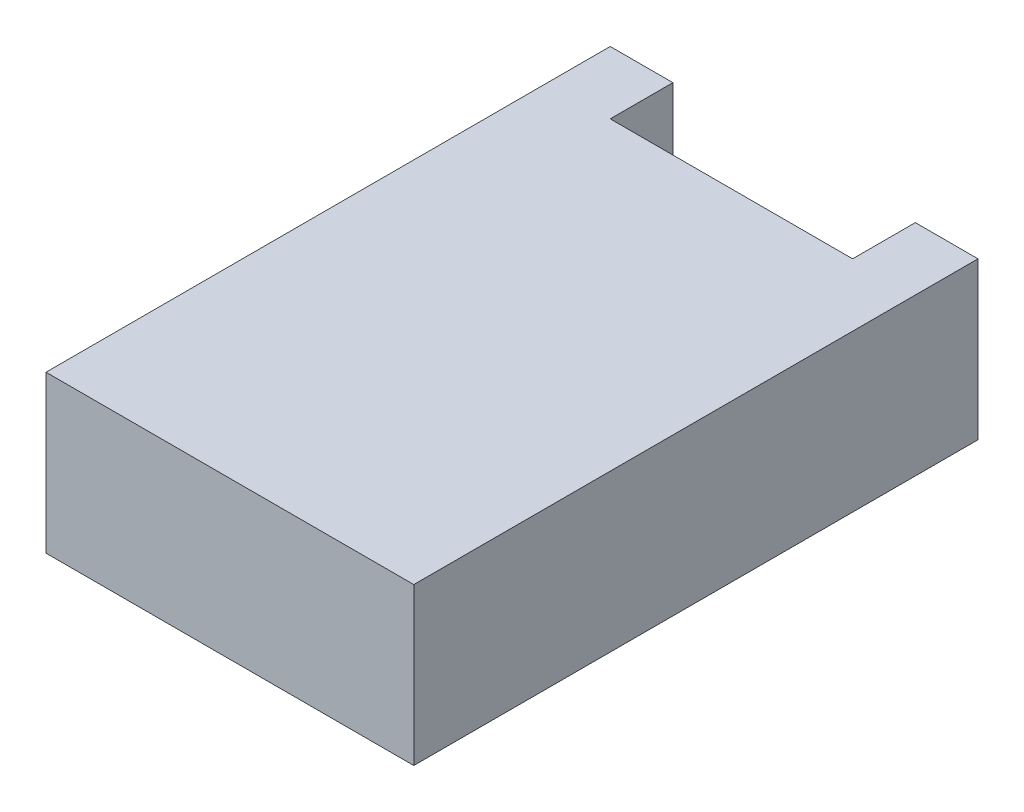
ISO-10303-21;
HEADER;
FILE_DESCRIPTION(('STEP AP214'),'2;1');
FILE_NAME('part.step','',(''),(''),'','','');
FILE_SCHEMA(('AUTOMOTIVE_DESIGN { 1 0 10303 214 1 1 1 1 }'));
ENDSEC;
DATA;
#1=APPLICATION_CONTEXT('core data for automotive mechanical design processes');
#2=APPLICATION_PROTOCOL_DEFINITION('international standard','automotive_design',2000,#1);
#3=PRODUCT_CONTEXT('',#1,'mechanical');
#4=PRODUCT('Part','Part','',(#3));
#5=PRODUCT_RELATED_PRODUCT_CATEGORY('part','',(#4));
#6=PRODUCT_DEFINITION_FORMATION('','',#4);
#7=PRODUCT_DEFINITION_CONTEXT('part definition',#1,'design');
#8=PRODUCT_DEFINITION('design','',#6,#7);
#9=PRODUCT_DEFINITION_SHAPE('','',#8);
#10=(LENGTH_UNIT() NAMED_UNIT(*) SI_UNIT(.MILLI.,.METRE.));
#11=(NAMED_UNIT(*) PLANE_ANGLE_UNIT() SI_UNIT($,.RADIAN.));
#12=(NAMED_UNIT(*) SI_UNIT($,.STERADIAN.) SOLID_ANGLE_UNIT());
#13=UNCERTAINTY_MEASURE_WITH_UNIT(LENGTH_MEASURE(1.E-05),#10,'distance_accuracy_value','');
#14=(GEOMETRIC_REPRESENTATION_CONTEXT(3) GLOBAL_UNCERTAINTY_ASSIGNED_CONTEXT((#13)) GLOBAL_UNIT_ASSIGNED_CONTEXT((#10,
#11,#12)) REPRESENTATION_CONTEXT('',''));
#15=CARTESIAN_POINT('',(0.,0.,0.));
#16=DIRECTION('',(0.,0.,1.));
#17=DIRECTION('',(1.,0.,0.));
#18=AXIS2_PLACEMENT_3D('',#15,#16,#17);
#19=CARTESIAN_POINT('',(8.8,7.5,-15.));
#20=DIRECTION('',(0.,0.,1.));
#21=DIRECTION('',(1.,0.,0.));
#22=AXIS2_PLACEMENT_3D('',#19,#20,#21);
#23=PLANE('',#22);
#24=DIRECTION('',(-1.,0.,0.));
#25=VECTOR('',#24,1.);
#26=CARTESIAN_POINT('',(8.8,0.,-15.));
#27=LINE('',#26,#25);
#28=CARTESIAN_POINT('',(8.8,0.,-15.));
#29=VERTEX_POINT('',#28);
#30=CARTESIAN_POINT('',(5.8,0.,-15.));
#31=VERTEX_POINT('',#30);
#32=EDGE_CURVE('E134',#29,#31,#27,.T.);
#33=ORIENTED_EDGE('',*,*,#32,.T.);
#34=DIRECTION('',(0.,-1.,0.));
#35=VECTOR('',#34,1.);
#36=CARTESIAN_POINT('',(5.8,7.5,-15.));
#37=LINE('',#36,#35);
#38=CARTESIAN_POINT('',(5.8,7.5,-15.));
#39=VERTEX_POINT('',#38);
#40=EDGE_CURVE('E42',#39,#31,#37,.T.);
#41=ORIENTED_EDGE('',*,*,#40,.F.);
#42=DIRECTION('',(-1.,0.,0.));
#43=VECTOR('',#42,1.);
#44=CARTESIAN_POINT('',(8.8,7.5,-15.));
#45=LINE('',#44,#43);
#46=CARTESIAN_POINT('',(8.8,7.5,-15.));
#47=VERTEX_POINT('',#46);
#48=EDGE_CURVE('E93',#47,#39,#45,.T.);
#49=ORIENTED_EDGE('',*,*,#48,.F.);
#50=DIRECTION('',(0.,-1.,0.));
#51=VECTOR('',#50,1.);
#52=CARTESIAN_POINT('',(8.8,7.5,-15.));
#53=LINE('',#52,#51);
#54=EDGE_CURVE('E11',#47,#29,#53,.T.);
#55=ORIENTED_EDGE('',*,*,#54,.T.);
#56=EDGE_LOOP('',(#33,#41,#49,#55));
#57=FACE_BOUND('',#56,.T.);
#58=ADVANCED_FACE('F34',(#57),#23,.F.);
#59=CARTESIAN_POINT('',(5.8,7.5,-12.));
#60=DIRECTION('',(1.,0.,0.));
#61=DIRECTION('',(0.,0.,-1.));
#62=AXIS2_PLACEMENT_3D('',#59,#60,#61);
#63=PLANE('',#62);
#64=DIRECTION('',(0.,0.,1.));
#65=VECTOR('',#64,1.);
#66=CARTESIAN_POINT('',(5.8,0.,-12.));
#67=LINE('',#66,#65);
#68=CARTESIAN_POINT('',(5.8,0.,-12.));
#69=VERTEX_POINT('',#68);
#70=EDGE_CURVE('E136',#31,#69,#67,.T.);
#71=ORIENTED_EDGE('',*,*,#70,.T.);
#72=DIRECTION('',(0.,-1.,0.));
#73=VECTOR('',#72,1.);
#74=CARTESIAN_POINT('',(5.8,7.5,-12.));
#75=LINE('',#74,#73);
#76=CARTESIAN_POINT('',(5.8,7.5,-12.));
#77=VERTEX_POINT('',#76);
#78=EDGE_CURVE('E153',#77,#69,#75,.T.);
#79=ORIENTED_EDGE('',*,*,#78,.F.);
#80=DIRECTION('',(0.,0.,1.));
#81=VECTOR('',#80,1.);
#82=CARTESIAN_POINT('',(5.8,7.5,-12.));
#83=LINE('',#82,#81);
#84=EDGE_CURVE('E161',#39,#77,#83,.T.);
#85=ORIENTED_EDGE('',*,*,#84,.F.);
#86=ORIENTED_EDGE('',*,*,#40,.T.);
#87=EDGE_LOOP('',(#71,#79,#85,#86));
#88=FACE_BOUND('',#87,.T.);
#89=ADVANCED_FACE('F159',(#88),#63,.F.);
#90=CARTESIAN_POINT('',(-5.8,7.5,-12.));
#91=DIRECTION('',(0.,0.,1.));
#92=DIRECTION('',(1.,0.,0.));
#93=AXIS2_PLACEMENT_3D('',#90,#91,#92);
#94=PLANE('',#93);
#95=DIRECTION('',(-1.,0.,0.));
#96=VECTOR('',#95,1.);
#97=CARTESIAN_POINT('',(-5.8,0.,-12.));
#98=LINE('',#97,#96);
#99=CARTESIAN_POINT('',(-5.8,0.,-12.));
#100=VERTEX_POINT('',#99);
#101=EDGE_CURVE('E138',#69,#100,#98,.T.);
#102=ORIENTED_EDGE('',*,*,#101,.T.);
#103=DIRECTION('',(0.,-1.,0.));
#104=VECTOR('',#103,1.);
#105=CARTESIAN_POINT('',(-5.8,7.5,-12.));
#106=LINE('',#105,#104);
#107=CARTESIAN_POINT('',(-5.8,7.5,-12.));
#108=VERTEX_POINT('',#107);
#109=EDGE_CURVE('E150',#108,#100,#106,.T.);
#110=ORIENTED_EDGE('',*,*,#109,.F.);
#111=DIRECTION('',(-1.,0.,0.));
#112=VECTOR('',#111,1.);
#113=CARTESIAN_POINT('',(-5.8,7.5,-12.));
#114=LINE('',#113,#112);
#115=EDGE_CURVE('E174',#77,#108,#114,.T.);
#116=ORIENTED_EDGE('',*,*,#115,.F.);
#117=ORIENTED_EDGE('',*,*,#78,.T.);
#118=EDGE_LOOP('',(#102,#110,#116,#117));
#119=FACE_BOUND('',#118,.T.);
#120=ADVANCED_FACE('F170',(#119),#94,.F.);
#121=CARTESIAN_POINT('',(-5.8,7.5,-12.));
#122=DIRECTION('',(-1.,0.,0.));
#123=DIRECTION('',(0.,0.,1.));
#124=AXIS2_PLACEMENT_3D('',#121,#122,#123);
#125=PLANE('',#124);
#126=DIRECTION('',(0.,0.,-1.));
#127=VECTOR('',#126,1.);
#128=CARTESIAN_POINT('',(-5.8,0.,-12.));
#129=LINE('',#128,#127);
#130=CARTESIAN_POINT('',(-5.8,0.,-15.));
#131=VERTEX_POINT('',#130);
#132=EDGE_CURVE('E140',#100,#131,#129,.T.);
#133=ORIENTED_EDGE('',*,*,#132,.T.);
#134=DIRECTION('',(0.,-1.,0.));
#135=VECTOR('',#134,1.);
#136=CARTESIAN_POINT('',(-5.8,7.5,-15.));
#137=LINE('',#136,#135);
#138=CARTESIAN_POINT('',(-5.8,7.5,-15.));
#139=VERTEX_POINT('',#138);
#140=EDGE_CURVE('E123',#139,#131,#137,.T.);
#141=ORIENTED_EDGE('',*,*,#140,.F.);
#142=DIRECTION('',(0.,0.,-1.));
#143=VECTOR('',#142,1.);
#144=CARTESIAN_POINT('',(-5.8,7.5,-12.));
#145=LINE('',#144,#143);
#146=EDGE_CURVE('E113',#108,#139,#145,.T.);
#147=ORIENTED_EDGE('',*,*,#146,.F.);
#148=ORIENTED_EDGE('',*,*,#109,.T.);
#149=EDGE_LOOP('',(#133,#141,#147,#148));
#150=FACE_BOUND('',#149,.T.);
#151=ADVANCED_FACE('F173',(#150),#125,.F.);
#152=CARTESIAN_POINT('',(-8.8,7.5,-15.));
#153=DIRECTION('',(0.,0.,1.));
#154=DIRECTION('',(1.,0.,0.));
#155=AXIS2_PLACEMENT_3D('',#152,#153,#154);
#156=PLANE('',#155);
#157=DIRECTION('',(-1.,0.,0.));
#158=VECTOR('',#157,1.);
#159=CARTESIAN_POINT('',(-8.8,0.,-15.));
#160=LINE('',#159,#158);
#161=CARTESIAN_POINT('',(-8.8,0.,-15.));
#162=VERTEX_POINT('',#161);
#163=EDGE_CURVE('E122',#131,#162,#160,.T.);
#164=ORIENTED_EDGE('',*,*,#163,.T.);
#165=DIRECTION('',(0.,-1.,0.));
#166=VECTOR('',#165,1.);
#167=CARTESIAN_POINT('',(-8.8,7.5,-15.));
#168=LINE('',#167,#166);
#169=CARTESIAN_POINT('',(-8.8,7.5,-15.));
#170=VERTEX_POINT('',#169);
#171=EDGE_CURVE('E119',#170,#162,#168,.T.);
#172=ORIENTED_EDGE('',*,*,#171,.F.);
#173=DIRECTION('',(-1.,0.,0.));
#174=VECTOR('',#173,1.);
#175=CARTESIAN_POINT('',(-8.8,7.5,-15.));
#176=LINE('',#175,#174);
#177=EDGE_CURVE('E107',#139,#170,#176,.T.);
#178=ORIENTED_EDGE('',*,*,#177,.F.);
#179=ORIENTED_EDGE('',*,*,#140,.T.);
#180=EDGE_LOOP('',(#164,#172,#178,#179));
#181=FACE_BOUND('',#180,.T.);
#182=ADVANCED_FACE('F120',(#181),#156,.F.);
#183=CARTESIAN_POINT('',(-8.8,7.5,12.));
#184=DIRECTION('',(1.,0.,0.));
#185=DIRECTION('',(0.,0.,-1.));
#186=AXIS2_PLACEMENT_3D('',#183,#184,#185);
#187=PLANE('',#186);
#188=DIRECTION('',(0.,0.,1.));
#189=VECTOR('',#188,1.);
#190=CARTESIAN_POINT('',(-8.8,0.,12.));
#191=LINE('',#190,#189);
#192=CARTESIAN_POINT('',(-8.8,0.,12.));
#193=VERTEX_POINT('',#192);
#194=EDGE_CURVE('E79',#162,#193,#191,.T.);
#195=ORIENTED_EDGE('',*,*,#194,.T.);
#196=DIRECTION('',(0.,-1.,0.));
#197=VECTOR('',#196,1.);
#198=CARTESIAN_POINT('',(-8.8,7.5,12.));
#199=LINE('',#198,#197);
#200=CARTESIAN_POINT('',(-8.8,7.5,12.));
#201=VERTEX_POINT('',#200);
#202=EDGE_CURVE('E124',#201,#193,#199,.T.);
#203=ORIENTED_EDGE('',*,*,#202,.F.);
#204=DIRECTION('',(0.,0.,1.));
#205=VECTOR('',#204,1.);
#206=CARTESIAN_POINT('',(-8.8,7.5,-12.));
#207=LINE('',#206,#205);
#208=EDGE_CURVE('E111',#170,#201,#207,.T.);
#209=ORIENTED_EDGE('',*,*,#208,.F.);
#210=ORIENTED_EDGE('',*,*,#171,.T.);
#211=EDGE_LOOP('',(#195,#203,#209,#210));
#212=FACE_BOUND('',#211,.T.);
#213=ADVANCED_FACE('F126',(#212),#187,.F.);
#214=CARTESIAN_POINT('',(-8.8,7.5,12.));
#215=DIRECTION('',(0.,0.,-1.));
#216=DIRECTION('',(-1.,0.,0.));
#217=AXIS2_PLACEMENT_3D('',#214,#215,#216);
#218=PLANE('',#217);
#219=DIRECTION('',(1.,0.,0.));
#220=VECTOR('',#219,1.);
#221=CARTESIAN_POINT('',(-8.8,0.,12.));
#222=LINE('',#221,#220);
#223=CARTESIAN_POINT('',(8.8,0.,12.));
#224=VERTEX_POINT('',#223);
#225=EDGE_CURVE('E86',#193,#224,#222,.T.);
#226=ORIENTED_EDGE('',*,*,#225,.T.);
#227=DIRECTION('',(0.,-1.,0.));
#228=VECTOR('',#227,1.);
#229=CARTESIAN_POINT('',(8.8,7.5,12.));
#230=LINE('',#229,#228);
#231=CARTESIAN_POINT('',(8.8,7.5,12.));
#232=VERTEX_POINT('',#231);
#233=EDGE_CURVE('E130',#232,#224,#230,.T.);
#234=ORIENTED_EDGE('',*,*,#233,.F.);
#235=DIRECTION('',(1.,0.,0.));
#236=VECTOR('',#235,1.);
#237=CARTESIAN_POINT('',(-8.8,7.5,12.));
#238=LINE('',#237,#236);
#239=EDGE_CURVE('E128',#201,#232,#238,.T.);
#240=ORIENTED_EDGE('',*,*,#239,.F.);
#241=ORIENTED_EDGE('',*,*,#202,.T.);
#242=EDGE_LOOP('',(#226,#234,#240,#241));
#243=FACE_BOUND('',#242,.T.);
#244=ADVANCED_FACE('F195',(#243),#218,.F.);
#245=CARTESIAN_POINT('',(8.8,7.5,12.));
#246=DIRECTION('',(-1.,0.,0.));
#247=DIRECTION('',(0.,0.,1.));
#248=AXIS2_PLACEMENT_3D('',#245,#246,#247);
#249=PLANE('',#248);
#250=DIRECTION('',(0.,0.,-1.));
#251=VECTOR('',#250,1.);
#252=CARTESIAN_POINT('',(8.8,0.,12.));
#253=LINE('',#252,#251);
#254=EDGE_CURVE('E145',#224,#29,#253,.T.);
#255=ORIENTED_EDGE('',*,*,#254,.T.);
#256=ORIENTED_EDGE('',*,*,#54,.F.);
#257=DIRECTION('',(0.,0.,-1.));
#258=VECTOR('',#257,1.);
#259=CARTESIAN_POINT('',(8.8,7.5,-12.));
#260=LINE('',#259,#258);
#261=EDGE_CURVE('E50',#232,#47,#260,.T.);
#262=ORIENTED_EDGE('',*,*,#261,.F.);
#263=ORIENTED_EDGE('',*,*,#233,.T.);
#264=EDGE_LOOP('',(#255,#256,#262,#263));
#265=FACE_BOUND('',#264,.T.);
#266=ADVANCED_FACE('F179',(#265),#249,.F.);
#267=CARTESIAN_POINT('',(0.,7.5,0.));
#268=DIRECTION('',(0.,1.,0.));
#269=DIRECTION('',(0.,0.,1.));
#270=AXIS2_PLACEMENT_3D('',#267,#268,#269);
#271=PLANE('',#270);
#272=ORIENTED_EDGE('',*,*,#261,.T.);
#273=ORIENTED_EDGE('',*,*,#48,.T.);
#274=ORIENTED_EDGE('',*,*,#84,.T.);
#275=ORIENTED_EDGE('',*,*,#115,.T.);
#276=ORIENTED_EDGE('',*,*,#146,.T.);
#277=ORIENTED_EDGE('',*,*,#177,.T.);
#278=ORIENTED_EDGE('',*,*,#208,.T.);
#279=ORIENTED_EDGE('',*,*,#239,.T.);
#280=EDGE_LOOP('',(#272,#273,#274,#275,#276,#277,#278,#279));
#281=FACE_BOUND('',#280,.T.);
#282=ADVANCED_FACE('F109',(#281),#271,.T.);
#283=CARTESIAN_POINT('',(0.,0.,0.));
#284=DIRECTION('',(0.,1.,0.));
#285=DIRECTION('',(0.,0.,1.));
#286=AXIS2_PLACEMENT_3D('',#283,#284,#285);
#287=PLANE('',#286);
#288=ORIENTED_EDGE('',*,*,#32,.F.);
#289=ORIENTED_EDGE('',*,*,#254,.F.);
#290=ORIENTED_EDGE('',*,*,#225,.F.);
#291=ORIENTED_EDGE('',*,*,#194,.F.);
#292=ORIENTED_EDGE('',*,*,#163,.F.);
#293=ORIENTED_EDGE('',*,*,#132,.F.);
#294=ORIENTED_EDGE('',*,*,#101,.F.);
#295=ORIENTED_EDGE('',*,*,#70,.F.);
#296=EDGE_LOOP('',(#288,#289,#290,#291,#292,#293,#294,#295));
#297=FACE_BOUND('',#296,.T.);
#298=ADVANCED_FACE('F165',(#297),#287,.F.);
#299=CLOSED_SHELL('',(#58,#89,#120,#151,#182,#213,#244,#266,#282,#298));
#300=MANIFOLD_SOLID_BREP('B2',#299);
#301=ADVANCED_BREP_SHAPE_REPRESENTATION('',(#18,#300),#14);
#302=SHAPE_DEFINITION_REPRESENTATION(#9,#301);
ENDSEC;
END-ISO-10303-21;
